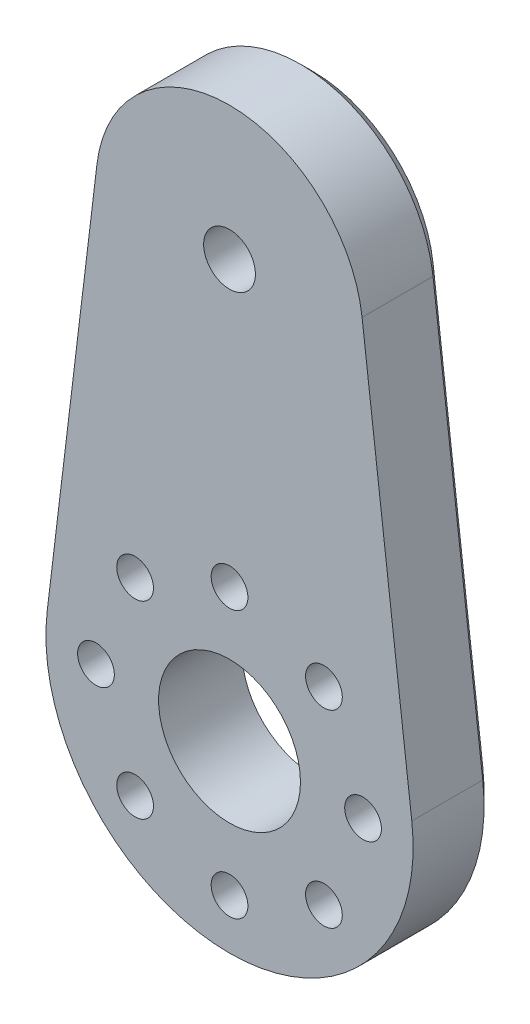
ISO-10303-21;
HEADER;
FILE_DESCRIPTION(('STEP AP214'),'2;1');
FILE_NAME('part.step','',(''),(''),'','','');
FILE_SCHEMA(('AUTOMOTIVE_DESIGN { 1 0 10303 214 1 1 1 1 }'));
ENDSEC;
DATA;
#1=APPLICATION_CONTEXT('core data for automotive mechanical design processes');
#2=APPLICATION_PROTOCOL_DEFINITION('international standard','automotive_design',2000,#1);
#3=PRODUCT_CONTEXT('',#1,'mechanical');
#4=PRODUCT('Part','Part','',(#3));
#5=PRODUCT_RELATED_PRODUCT_CATEGORY('part','',(#4));
#6=PRODUCT_DEFINITION_FORMATION('','',#4);
#7=PRODUCT_DEFINITION_CONTEXT('part definition',#1,'design');
#8=PRODUCT_DEFINITION('design','',#6,#7);
#9=PRODUCT_DEFINITION_SHAPE('','',#8);
#10=(LENGTH_UNIT() NAMED_UNIT(*) SI_UNIT(.MILLI.,.METRE.));
#11=(NAMED_UNIT(*) PLANE_ANGLE_UNIT() SI_UNIT($,.RADIAN.));
#12=(NAMED_UNIT(*) SI_UNIT($,.STERADIAN.) SOLID_ANGLE_UNIT());
#13=UNCERTAINTY_MEASURE_WITH_UNIT(LENGTH_MEASURE(1.E-05),#10,'distance_accuracy_value','');
#14=(GEOMETRIC_REPRESENTATION_CONTEXT(3) GLOBAL_UNCERTAINTY_ASSIGNED_CONTEXT((#13)) GLOBAL_UNIT_ASSIGNED_CONTEXT((#10,
#11,#12)) REPRESENTATION_CONTEXT('',''));
#15=CARTESIAN_POINT('',(0.,0.,0.));
#16=DIRECTION('',(0.,0.,1.));
#17=DIRECTION('',(1.,0.,0.));
#18=AXIS2_PLACEMENT_3D('',#15,#16,#17);
#19=CARTESIAN_POINT('',(-7.07862408504097,-19.7439036018759,5.));
#20=DIRECTION('',(0.,0.,-1.));
#21=DIRECTION('',(-1.,0.,0.));
#22=AXIS2_PLACEMENT_3D('',#19,#20,#21);
#23=CYLINDRICAL_SURFACE('',#22,1.1);
#24=CARTESIAN_POINT('',(-7.07862408504097,-19.7439036018759,5.));
#25=DIRECTION('',(0.,0.,1.));
#26=DIRECTION('',(1.,0.,0.));
#27=AXIS2_PLACEMENT_3D('',#24,#25,#26);
#28=CIRCLE('',#27,1.1);
#29=CARTESIAN_POINT('',(-5.97862408504097,-19.7439036018759,5.));
#30=VERTEX_POINT('',#29);
#31=EDGE_CURVE('E179',#30,#30,#28,.T.);
#32=ORIENTED_EDGE('',*,*,#31,.T.);
#33=EDGE_LOOP('',(#32));
#34=FACE_BOUND('',#33,.T.);
#35=CARTESIAN_POINT('',(-7.07862408504097,-19.7439036018759,2.25));
#36=DIRECTION('',(0.,0.,-1.));
#37=DIRECTION('',(-1.,0.,0.));
#38=AXIS2_PLACEMENT_3D('',#35,#36,#37);
#39=CIRCLE('',#38,1.1);
#40=CARTESIAN_POINT('',(-8.17862408504097,-19.7439036018759,2.25));
#41=VERTEX_POINT('',#40);
#42=EDGE_CURVE('E232',#41,#41,#39,.T.);
#43=ORIENTED_EDGE('',*,*,#42,.T.);
#44=EDGE_LOOP('',(#43));
#45=FACE_BOUND('',#44,.T.);
#46=ADVANCED_FACE('F33',(#34,#45),#23,.F.);
#47=CARTESIAN_POINT('',(-9.42176983554858,-25.4007578513683,5.));
#48=DIRECTION('',(0.,0.,-1.));
#49=DIRECTION('',(-1.,0.,0.));
#50=AXIS2_PLACEMENT_3D('',#47,#48,#49);
#51=CYLINDRICAL_SURFACE('',#50,1.1);
#52=CARTESIAN_POINT('',(-9.42176983554858,-25.4007578513683,5.));
#53=DIRECTION('',(0.,0.,1.));
#54=DIRECTION('',(1.,0.,0.));
#55=AXIS2_PLACEMENT_3D('',#52,#53,#54);
#56=CIRCLE('',#55,1.1);
#57=CARTESIAN_POINT('',(-8.32176983554858,-25.4007578513683,5.));
#58=VERTEX_POINT('',#57);
#59=EDGE_CURVE('E176',#58,#58,#56,.T.);
#60=ORIENTED_EDGE('',*,*,#59,.T.);
#61=EDGE_LOOP('',(#60));
#62=FACE_BOUND('',#61,.T.);
#63=CARTESIAN_POINT('',(-9.42176983554858,-25.4007578513683,2.25));
#64=DIRECTION('',(0.,0.,-1.));
#65=DIRECTION('',(-1.,0.,0.));
#66=AXIS2_PLACEMENT_3D('',#63,#64,#65);
#67=CIRCLE('',#66,1.1);
#68=CARTESIAN_POINT('',(-10.5217698355486,-25.4007578513683,2.25));
#69=VERTEX_POINT('',#68);
#70=EDGE_CURVE('E229',#69,#69,#67,.T.);
#71=ORIENTED_EDGE('',*,*,#70,.T.);
#72=EDGE_LOOP('',(#71));
#73=FACE_BOUND('',#72,.T.);
#74=ADVANCED_FACE('F330',(#62,#73),#51,.F.);
#75=CARTESIAN_POINT('',(-15.078624085041,-27.7439036018759,5.));
#76=DIRECTION('',(0.,0.,-1.));
#77=DIRECTION('',(-1.,0.,0.));
#78=AXIS2_PLACEMENT_3D('',#75,#76,#77);
#79=CYLINDRICAL_SURFACE('',#78,1.1);
#80=CARTESIAN_POINT('',(-15.078624085041,-27.7439036018759,5.));
#81=DIRECTION('',(0.,0.,1.));
#82=DIRECTION('',(1.,0.,0.));
#83=AXIS2_PLACEMENT_3D('',#80,#81,#82);
#84=CIRCLE('',#83,1.1);
#85=CARTESIAN_POINT('',(-13.978624085041,-27.7439036018759,5.));
#86=VERTEX_POINT('',#85);
#87=EDGE_CURVE('E173',#86,#86,#84,.T.);
#88=ORIENTED_EDGE('',*,*,#87,.T.);
#89=EDGE_LOOP('',(#88));
#90=FACE_BOUND('',#89,.T.);
#91=CARTESIAN_POINT('',(-15.078624085041,-27.7439036018759,2.25));
#92=DIRECTION('',(0.,0.,-1.));
#93=DIRECTION('',(-1.,0.,0.));
#94=AXIS2_PLACEMENT_3D('',#91,#92,#93);
#95=CIRCLE('',#94,1.1);
#96=CARTESIAN_POINT('',(-16.178624085041,-27.7439036018759,2.25));
#97=VERTEX_POINT('',#96);
#98=EDGE_CURVE('E226',#97,#97,#95,.T.);
#99=ORIENTED_EDGE('',*,*,#98,.T.);
#100=EDGE_LOOP('',(#99));
#101=FACE_BOUND('',#100,.T.);
#102=ADVANCED_FACE('F336',(#90,#101),#79,.F.);
#103=CARTESIAN_POINT('',(-20.7354783345333,-25.4007578513683,5.));
#104=DIRECTION('',(0.,0.,-1.));
#105=DIRECTION('',(-1.,0.,0.));
#106=AXIS2_PLACEMENT_3D('',#103,#104,#105);
#107=CYLINDRICAL_SURFACE('',#106,1.1);
#108=CARTESIAN_POINT('',(-20.7354783345333,-25.4007578513683,5.));
#109=DIRECTION('',(0.,0.,1.));
#110=DIRECTION('',(1.,0.,0.));
#111=AXIS2_PLACEMENT_3D('',#108,#109,#110);
#112=CIRCLE('',#111,1.1);
#113=CARTESIAN_POINT('',(-19.6354783345333,-25.4007578513683,5.));
#114=VERTEX_POINT('',#113);
#115=EDGE_CURVE('E170',#114,#114,#112,.T.);
#116=ORIENTED_EDGE('',*,*,#115,.T.);
#117=EDGE_LOOP('',(#116));
#118=FACE_BOUND('',#117,.T.);
#119=CARTESIAN_POINT('',(-20.7354783345333,-25.4007578513683,2.25));
#120=DIRECTION('',(0.,0.,-1.));
#121=DIRECTION('',(-1.,0.,0.));
#122=AXIS2_PLACEMENT_3D('',#119,#120,#121);
#123=CIRCLE('',#122,1.1);
#124=CARTESIAN_POINT('',(-21.8354783345333,-25.4007578513683,2.25));
#125=VERTEX_POINT('',#124);
#126=EDGE_CURVE('E223',#125,#125,#123,.T.);
#127=ORIENTED_EDGE('',*,*,#126,.T.);
#128=EDGE_LOOP('',(#127));
#129=FACE_BOUND('',#128,.T.);
#130=ADVANCED_FACE('F722',(#118,#129),#107,.F.);
#131=CARTESIAN_POINT('',(-23.078624085041,-19.7439036018759,5.));
#132=DIRECTION('',(0.,0.,-1.));
#133=DIRECTION('',(-1.,0.,0.));
#134=AXIS2_PLACEMENT_3D('',#131,#132,#133);
#135=CYLINDRICAL_SURFACE('',#134,1.1);
#136=CARTESIAN_POINT('',(-23.078624085041,-19.7439036018759,5.));
#137=DIRECTION('',(0.,0.,1.));
#138=DIRECTION('',(1.,0.,0.));
#139=AXIS2_PLACEMENT_3D('',#136,#137,#138);
#140=CIRCLE('',#139,1.1);
#141=CARTESIAN_POINT('',(-21.978624085041,-19.7439036018759,5.));
#142=VERTEX_POINT('',#141);
#143=EDGE_CURVE('E167',#142,#142,#140,.T.);
#144=ORIENTED_EDGE('',*,*,#143,.T.);
#145=EDGE_LOOP('',(#144));
#146=FACE_BOUND('',#145,.T.);
#147=CARTESIAN_POINT('',(-23.078624085041,-19.7439036018759,2.25));
#148=DIRECTION('',(0.,0.,-1.));
#149=DIRECTION('',(-1.,0.,0.));
#150=AXIS2_PLACEMENT_3D('',#147,#148,#149);
#151=CIRCLE('',#150,1.1);
#152=CARTESIAN_POINT('',(-24.178624085041,-19.7439036018759,2.25));
#153=VERTEX_POINT('',#152);
#154=EDGE_CURVE('E220',#153,#153,#151,.T.);
#155=ORIENTED_EDGE('',*,*,#154,.T.);
#156=EDGE_LOOP('',(#155));
#157=FACE_BOUND('',#156,.T.);
#158=ADVANCED_FACE('F731',(#146,#157),#135,.F.);
#159=CARTESIAN_POINT('',(-20.7354783345334,-14.0870493523836,5.));
#160=DIRECTION('',(0.,0.,-1.));
#161=DIRECTION('',(-1.,0.,0.));
#162=AXIS2_PLACEMENT_3D('',#159,#160,#161);
#163=CYLINDRICAL_SURFACE('',#162,1.1);
#164=CARTESIAN_POINT('',(-20.7354783345334,-14.0870493523836,5.));
#165=DIRECTION('',(0.,0.,1.));
#166=DIRECTION('',(1.,0.,0.));
#167=AXIS2_PLACEMENT_3D('',#164,#165,#166);
#168=CIRCLE('',#167,1.1);
#169=CARTESIAN_POINT('',(-19.6354783345334,-14.0870493523836,5.));
#170=VERTEX_POINT('',#169);
#171=EDGE_CURVE('E164',#170,#170,#168,.T.);
#172=ORIENTED_EDGE('',*,*,#171,.T.);
#173=EDGE_LOOP('',(#172));
#174=FACE_BOUND('',#173,.T.);
#175=CARTESIAN_POINT('',(-20.7354783345334,-14.0870493523836,2.25));
#176=DIRECTION('',(0.,0.,-1.));
#177=DIRECTION('',(-1.,0.,0.));
#178=AXIS2_PLACEMENT_3D('',#175,#176,#177);
#179=CIRCLE('',#178,1.1);
#180=CARTESIAN_POINT('',(-21.8354783345334,-14.0870493523836,2.25));
#181=VERTEX_POINT('',#180);
#182=EDGE_CURVE('E217',#181,#181,#179,.T.);
#183=ORIENTED_EDGE('',*,*,#182,.T.);
#184=EDGE_LOOP('',(#183));
#185=FACE_BOUND('',#184,.T.);
#186=ADVANCED_FACE('F741',(#174,#185),#163,.F.);
#187=CARTESIAN_POINT('',(-15.078624085041,-11.7439036018759,5.));
#188=DIRECTION('',(0.,0.,-1.));
#189=DIRECTION('',(-1.,0.,0.));
#190=AXIS2_PLACEMENT_3D('',#187,#188,#189);
#191=CYLINDRICAL_SURFACE('',#190,1.1);
#192=CARTESIAN_POINT('',(-15.078624085041,-11.7439036018759,5.));
#193=DIRECTION('',(0.,0.,1.));
#194=DIRECTION('',(1.,0.,0.));
#195=AXIS2_PLACEMENT_3D('',#192,#193,#194);
#196=CIRCLE('',#195,1.1);
#197=CARTESIAN_POINT('',(-13.978624085041,-11.7439036018759,5.));
#198=VERTEX_POINT('',#197);
#199=EDGE_CURVE('E161',#198,#198,#196,.T.);
#200=ORIENTED_EDGE('',*,*,#199,.T.);
#201=EDGE_LOOP('',(#200));
#202=FACE_BOUND('',#201,.T.);
#203=CARTESIAN_POINT('',(-15.078624085041,-11.7439036018759,2.25));
#204=DIRECTION('',(0.,0.,-1.));
#205=DIRECTION('',(-1.,0.,0.));
#206=AXIS2_PLACEMENT_3D('',#203,#204,#205);
#207=CIRCLE('',#206,1.1);
#208=CARTESIAN_POINT('',(-16.178624085041,-11.7439036018759,2.25));
#209=VERTEX_POINT('',#208);
#210=EDGE_CURVE('E213',#209,#209,#207,.T.);
#211=ORIENTED_EDGE('',*,*,#210,.T.);
#212=EDGE_LOOP('',(#211));
#213=FACE_BOUND('',#212,.T.);
#214=ADVANCED_FACE('F416',(#202,#213),#191,.F.);
#215=CARTESIAN_POINT('',(-9.42176983554858,-14.0870493523836,5.));
#216=DIRECTION('',(0.,0.,-1.));
#217=DIRECTION('',(-1.,0.,0.));
#218=AXIS2_PLACEMENT_3D('',#215,#216,#217);
#219=CYLINDRICAL_SURFACE('',#218,1.1);
#220=CARTESIAN_POINT('',(-9.42176983554858,-14.0870493523836,5.));
#221=DIRECTION('',(0.,0.,1.));
#222=DIRECTION('',(1.,0.,0.));
#223=AXIS2_PLACEMENT_3D('',#220,#221,#222);
#224=CIRCLE('',#223,1.1);
#225=CARTESIAN_POINT('',(-8.32176983554858,-14.0870493523836,5.));
#226=VERTEX_POINT('',#225);
#227=EDGE_CURVE('E153',#226,#226,#224,.T.);
#228=ORIENTED_EDGE('',*,*,#227,.T.);
#229=EDGE_LOOP('',(#228));
#230=FACE_BOUND('',#229,.T.);
#231=CARTESIAN_POINT('',(-9.42176983554858,-14.0870493523836,2.25));
#232=DIRECTION('',(0.,0.,-1.));
#233=DIRECTION('',(-1.,0.,0.));
#234=AXIS2_PLACEMENT_3D('',#231,#232,#233);
#235=CIRCLE('',#234,1.1);
#236=CARTESIAN_POINT('',(-10.5217698355486,-14.0870493523836,2.25));
#237=VERTEX_POINT('',#236);
#238=EDGE_CURVE('E210',#237,#237,#235,.T.);
#239=ORIENTED_EDGE('',*,*,#238,.T.);
#240=EDGE_LOOP('',(#239));
#241=FACE_BOUND('',#240,.T.);
#242=ADVANCED_FACE('F358',(#230,#241),#219,.F.);
#243=CARTESIAN_POINT('',(-15.078624085041,5.25609639812406,0.));
#244=DIRECTION('',(0.,0.,1.));
#245=DIRECTION('',(1.,0.,0.));
#246=AXIS2_PLACEMENT_3D('',#243,#244,#245);
#247=PLANE('',#246);
#248=CARTESIAN_POINT('',(-15.078624085041,-19.7439036018759,0.));
#249=DIRECTION('',(0.,0.,1.));
#250=DIRECTION('',(1.,0.,0.));
#251=AXIS2_PLACEMENT_3D('',#248,#249,#250);
#252=CIRCLE('',#251,10.25);
#253=CARTESIAN_POINT('',(-4.90269169532847,-18.5139036018759,0.));
#254=VERTEX_POINT('',#253);
#255=CARTESIAN_POINT('',(-25.2545564747535,-18.5139036018759,0.));
#256=VERTEX_POINT('',#255);
#257=EDGE_CURVE('E242',#254,#256,#252,.F.);
#258=ORIENTED_EDGE('',*,*,#257,.T.);
#259=DIRECTION('',(0.12,0.992773891679269,0.));
#260=VECTOR('',#259,1.);
#261=CARTESIAN_POINT('',(-22.2762347997157,6.12609639812406,0.));
#262=LINE('',#261,#260);
#263=CARTESIAN_POINT('',(-22.2762347997157,6.12609639812406,0.));
#264=VERTEX_POINT('',#263);
#265=EDGE_CURVE('E244',#256,#264,#262,.T.);
#266=ORIENTED_EDGE('',*,*,#265,.T.);
#267=CARTESIAN_POINT('',(-15.078624085041,5.25609639812406,0.));
#268=DIRECTION('',(0.,0.,1.));
#269=DIRECTION('',(1.,0.,0.));
#270=AXIS2_PLACEMENT_3D('',#267,#268,#269);
#271=CIRCLE('',#270,7.25);
#272=CARTESIAN_POINT('',(-7.88101337036627,6.12609639812406,0.));
#273=VERTEX_POINT('',#272);
#274=EDGE_CURVE('E240',#264,#273,#271,.F.);
#275=ORIENTED_EDGE('',*,*,#274,.T.);
#276=DIRECTION('',(0.12,-0.992773891679269,0.));
#277=VECTOR('',#276,1.);
#278=CARTESIAN_POINT('',(-7.88101337036627,6.12609639812406,0.));
#279=LINE('',#278,#277);
#280=EDGE_CURVE('E238',#273,#254,#279,.T.);
#281=ORIENTED_EDGE('',*,*,#280,.T.);
#282=EDGE_LOOP('',(#258,#266,#275,#281));
#283=FACE_BOUND('',#282,.T.);
#284=CARTESIAN_POINT('',(-20.7354783345333,-14.0870493523836,0.));
#285=DIRECTION('',(0.,0.,-1.));
#286=DIRECTION('',(-1.,0.,0.));
#287=AXIS2_PLACEMENT_3D('',#284,#285,#286);
#288=CIRCLE('',#287,1.75);
#289=CARTESIAN_POINT('',(-22.4854783345333,-14.0870493523836,0.));
#290=VERTEX_POINT('',#289);
#291=EDGE_CURVE('E258',#290,#290,#288,.T.);
#292=ORIENTED_EDGE('',*,*,#291,.F.);
#293=EDGE_LOOP('',(#292));
#294=FACE_BOUND('',#293,.T.);
#295=CARTESIAN_POINT('',(-15.078624085041,-11.7439036018759,0.));
#296=DIRECTION('',(0.,0.,-1.));
#297=DIRECTION('',(-1.,0.,0.));
#298=AXIS2_PLACEMENT_3D('',#295,#296,#297);
#299=CIRCLE('',#298,1.75);
#300=CARTESIAN_POINT('',(-16.828624085041,-11.7439036018759,0.));
#301=VERTEX_POINT('',#300);
#302=EDGE_CURVE('E269',#301,#301,#299,.T.);
#303=ORIENTED_EDGE('',*,*,#302,.F.);
#304=EDGE_LOOP('',(#303));
#305=FACE_BOUND('',#304,.T.);
#306=CARTESIAN_POINT('',(-9.42176983554858,-14.0870493523836,0.));
#307=DIRECTION('',(0.,0.,-1.));
#308=DIRECTION('',(-1.,0.,0.));
#309=AXIS2_PLACEMENT_3D('',#306,#307,#308);
#310=CIRCLE('',#309,1.75);
#311=CARTESIAN_POINT('',(-11.1717698355486,-14.0870493523836,0.));
#312=VERTEX_POINT('',#311);
#313=EDGE_CURVE('E431',#312,#312,#310,.T.);
#314=ORIENTED_EDGE('',*,*,#313,.F.);
#315=EDGE_LOOP('',(#314));
#316=FACE_BOUND('',#315,.T.);
#317=CARTESIAN_POINT('',(-7.07862408504097,-19.7439036018759,0.));
#318=DIRECTION('',(0.,0.,-1.));
#319=DIRECTION('',(-1.,0.,0.));
#320=AXIS2_PLACEMENT_3D('',#317,#318,#319);
#321=CIRCLE('',#320,1.75);
#322=CARTESIAN_POINT('',(-8.82862408504097,-19.7439036018759,0.));
#323=VERTEX_POINT('',#322);
#324=EDGE_CURVE('E430',#323,#323,#321,.T.);
#325=ORIENTED_EDGE('',*,*,#324,.F.);
#326=EDGE_LOOP('',(#325));
#327=FACE_BOUND('',#326,.T.);
#328=CARTESIAN_POINT('',(-9.42176983554858,-25.4007578513683,0.));
#329=DIRECTION('',(0.,0.,-1.));
#330=DIRECTION('',(-1.,0.,0.));
#331=AXIS2_PLACEMENT_3D('',#328,#329,#330);
#332=CIRCLE('',#331,1.75);
#333=CARTESIAN_POINT('',(-11.1717698355486,-25.4007578513683,0.));
#334=VERTEX_POINT('',#333);
#335=EDGE_CURVE('E454',#334,#334,#332,.T.);
#336=ORIENTED_EDGE('',*,*,#335,.F.);
#337=EDGE_LOOP('',(#336));
#338=FACE_BOUND('',#337,.T.);
#339=CARTESIAN_POINT('',(-15.078624085041,-27.7439036018759,0.));
#340=DIRECTION('',(0.,0.,-1.));
#341=DIRECTION('',(-1.,0.,0.));
#342=AXIS2_PLACEMENT_3D('',#339,#340,#341);
#343=CIRCLE('',#342,1.75);
#344=CARTESIAN_POINT('',(-16.828624085041,-27.7439036018759,0.));
#345=VERTEX_POINT('',#344);
#346=EDGE_CURVE('E458',#345,#345,#343,.T.);
#347=ORIENTED_EDGE('',*,*,#346,.F.);
#348=EDGE_LOOP('',(#347));
#349=FACE_BOUND('',#348,.T.);
#350=CARTESIAN_POINT('',(-20.7354783345333,-25.4007578513683,0.));
#351=DIRECTION('',(0.,0.,-1.));
#352=DIRECTION('',(-1.,0.,0.));
#353=AXIS2_PLACEMENT_3D('',#350,#351,#352);
#354=CIRCLE('',#353,1.74999999999999);
#355=CARTESIAN_POINT('',(-22.4854783345333,-25.4007578513683,0.));
#356=VERTEX_POINT('',#355);
#357=EDGE_CURVE('E462',#356,#356,#354,.T.);
#358=ORIENTED_EDGE('',*,*,#357,.F.);
#359=EDGE_LOOP('',(#358));
#360=FACE_BOUND('',#359,.T.);
#361=CARTESIAN_POINT('',(-23.078624085041,-19.7439036018759,0.));
#362=DIRECTION('',(0.,0.,-1.));
#363=DIRECTION('',(-1.,0.,0.));
#364=AXIS2_PLACEMENT_3D('',#361,#362,#363);
#365=CIRCLE('',#364,1.75);
#366=CARTESIAN_POINT('',(-24.828624085041,-19.7439036018759,0.));
#367=VERTEX_POINT('',#366);
#368=EDGE_CURVE('E275',#367,#367,#365,.T.);
#369=ORIENTED_EDGE('',*,*,#368,.F.);
#370=EDGE_LOOP('',(#369));
#371=FACE_BOUND('',#370,.T.);
#372=CARTESIAN_POINT('',(-15.078624085041,-19.7439036018759,0.));
#373=DIRECTION('',(0.,0.,1.));
#374=DIRECTION('',(1.,0.,0.));
#375=AXIS2_PLACEMENT_3D('',#372,#373,#374);
#376=CIRCLE('',#375,4.25);
#377=CARTESIAN_POINT('',(-10.828624085041,-19.7439036018759,0.));
#378=VERTEX_POINT('',#377);
#379=EDGE_CURVE('E182',#378,#378,#376,.T.);
#380=ORIENTED_EDGE('',*,*,#379,.T.);
#381=EDGE_LOOP('',(#380));
#382=FACE_BOUND('',#381,.T.);
#383=DIRECTION('',(1.,0.,0.));
#384=VECTOR('',#383,1.);
#385=CARTESIAN_POINT('',(-16.6663373253124,2.50609639812406,0.));
#386=LINE('',#385,#384);
#387=CARTESIAN_POINT('',(-16.6663373253124,2.50609639812406,0.));
#388=VERTEX_POINT('',#387);
#389=CARTESIAN_POINT('',(-13.4909108447695,2.50609639812407,0.));
#390=VERTEX_POINT('',#389);
#391=EDGE_CURVE('E235',#388,#390,#386,.T.);
#392=ORIENTED_EDGE('',*,*,#391,.T.);
#393=DIRECTION('',(0.5,0.866025403784439,0.));
#394=VECTOR('',#393,1.);
#395=CARTESIAN_POINT('',(-13.4909108447695,2.50609639812407,0.));
#396=LINE('',#395,#394);
#397=CARTESIAN_POINT('',(-11.903197604498,5.25609639812406,0.));
#398=VERTEX_POINT('',#397);
#399=EDGE_CURVE('E148',#390,#398,#396,.T.);
#400=ORIENTED_EDGE('',*,*,#399,.T.);
#401=DIRECTION('',(-0.5,0.866025403784439,0.));
#402=VECTOR('',#401,1.);
#403=CARTESIAN_POINT('',(-11.903197604498,5.25609639812406,0.));
#404=LINE('',#403,#402);
#405=CARTESIAN_POINT('',(-13.4909108447695,8.00609639812406,0.));
#406=VERTEX_POINT('',#405);
#407=EDGE_CURVE('E288',#398,#406,#404,.T.);
#408=ORIENTED_EDGE('',*,*,#407,.T.);
#409=DIRECTION('',(-1.,0.,0.));
#410=VECTOR('',#409,1.);
#411=CARTESIAN_POINT('',(-13.4909108447695,8.00609639812406,0.));
#412=LINE('',#411,#410);
#413=CARTESIAN_POINT('',(-16.6663373253124,8.00609639812406,0.));
#414=VERTEX_POINT('',#413);
#415=EDGE_CURVE('E291',#406,#414,#412,.T.);
#416=ORIENTED_EDGE('',*,*,#415,.T.);
#417=DIRECTION('',(-0.499999999999999,-0.866025403784439,0.));
#418=VECTOR('',#417,1.);
#419=CARTESIAN_POINT('',(-16.6663373253124,8.00609639812406,0.));
#420=LINE('',#419,#418);
#421=CARTESIAN_POINT('',(-18.2540505655839,5.25609639812407,0.));
#422=VERTEX_POINT('',#421);
#423=EDGE_CURVE('E294',#414,#422,#420,.T.);
#424=ORIENTED_EDGE('',*,*,#423,.T.);
#425=DIRECTION('',(0.5,-0.866025403784438,0.));
#426=VECTOR('',#425,1.);
#427=CARTESIAN_POINT('',(-18.2540505655839,5.25609639812407,0.));
#428=LINE('',#427,#426);
#429=EDGE_CURVE('E144',#422,#388,#428,.T.);
#430=ORIENTED_EDGE('',*,*,#429,.T.);
#431=EDGE_LOOP('',(#392,#400,#408,#416,#424,#430));
#432=FACE_BOUND('',#431,.T.);
#433=ADVANCED_FACE('F313',(#283,#294,#305,#316,#327,#338,#349,#360,#371,#382,#432),#247,.F.);
#434=CARTESIAN_POINT('',(-15.078624085041,5.25609639812406,5.));
#435=DIRECTION('',(0.,0.,1.));
#436=DIRECTION('',(1.,0.,0.));
#437=AXIS2_PLACEMENT_3D('',#434,#435,#436);
#438=PLANE('',#437);
#439=ORIENTED_EDGE('',*,*,#199,.F.);
#440=EDGE_LOOP('',(#439));
#441=FACE_BOUND('',#440,.T.);
#442=ORIENTED_EDGE('',*,*,#143,.F.);
#443=EDGE_LOOP('',(#442));
#444=FACE_BOUND('',#443,.T.);
#445=ORIENTED_EDGE('',*,*,#87,.F.);
#446=EDGE_LOOP('',(#445));
#447=FACE_BOUND('',#446,.T.);
#448=ORIENTED_EDGE('',*,*,#31,.F.);
#449=EDGE_LOOP('',(#448));
#450=FACE_BOUND('',#449,.T.);
#451=CARTESIAN_POINT('',(-15.078624085041,5.25609639812406,5.));
#452=DIRECTION('',(0.,0.,1.));
#453=DIRECTION('',(1.,0.,0.));
#454=AXIS2_PLACEMENT_3D('',#451,#452,#453);
#455=CIRCLE('',#454,1.55);
#456=CARTESIAN_POINT('',(-13.528624085041,5.25609639812406,5.));
#457=VERTEX_POINT('',#456);
#458=EDGE_CURVE('E186',#457,#457,#455,.T.);
#459=ORIENTED_EDGE('',*,*,#458,.F.);
#460=EDGE_LOOP('',(#459));
#461=FACE_BOUND('',#460,.T.);
#462=CARTESIAN_POINT('',(-15.078624085041,5.25609639812406,5.));
#463=DIRECTION('',(0.,0.,1.));
#464=DIRECTION('',(1.,0.,0.));
#465=AXIS2_PLACEMENT_3D('',#462,#463,#464);
#466=CIRCLE('',#465,8.);
#467=CARTESIAN_POINT('',(-7.13643295160682,6.21609639812406,5.));
#468=VERTEX_POINT('',#467);
#469=CARTESIAN_POINT('',(-23.0208152184751,6.21609639812406,5.));
#470=VERTEX_POINT('',#469);
#471=EDGE_CURVE('E191',#468,#470,#466,.T.);
#472=ORIENTED_EDGE('',*,*,#471,.T.);
#473=DIRECTION('',(-0.12,-0.992773891679269,0.));
#474=VECTOR('',#473,1.);
#475=CARTESIAN_POINT('',(-23.0208152184751,6.21609639812406,5.));
#476=LINE('',#475,#474);
#477=CARTESIAN_POINT('',(-25.9991368935129,-18.4239036018759,5.));
#478=VERTEX_POINT('',#477);
#479=EDGE_CURVE('E194',#470,#478,#476,.T.);
#480=ORIENTED_EDGE('',*,*,#479,.T.);
#481=CARTESIAN_POINT('',(-15.078624085041,-19.7439036018759,5.));
#482=DIRECTION('',(0.,0.,1.));
#483=DIRECTION('',(1.,0.,0.));
#484=AXIS2_PLACEMENT_3D('',#481,#482,#483);
#485=CIRCLE('',#484,11.);
#486=CARTESIAN_POINT('',(-4.15811127656901,-18.4239036018759,5.));
#487=VERTEX_POINT('',#486);
#488=EDGE_CURVE('E196',#478,#487,#485,.T.);
#489=ORIENTED_EDGE('',*,*,#488,.T.);
#490=DIRECTION('',(-0.12,0.992773891679269,0.));
#491=VECTOR('',#490,1.);
#492=CARTESIAN_POINT('',(-7.13643295160682,6.21609639812406,5.));
#493=LINE('',#492,#491);
#494=EDGE_CURVE('E198',#487,#468,#493,.T.);
#495=ORIENTED_EDGE('',*,*,#494,.T.);
#496=EDGE_LOOP('',(#472,#480,#489,#495));
#497=FACE_BOUND('',#496,.T.);
#498=CARTESIAN_POINT('',(-15.078624085041,-19.7439036018759,5.));
#499=DIRECTION('',(0.,0.,1.));
#500=DIRECTION('',(1.,0.,0.));
#501=AXIS2_PLACEMENT_3D('',#498,#499,#500);
#502=CIRCLE('',#501,4.25);
#503=CARTESIAN_POINT('',(-10.828624085041,-19.7439036018759,5.));
#504=VERTEX_POINT('',#503);
#505=EDGE_CURVE('E183',#504,#504,#502,.T.);
#506=ORIENTED_EDGE('',*,*,#505,.F.);
#507=EDGE_LOOP('',(#506));
#508=FACE_BOUND('',#507,.T.);
#509=ORIENTED_EDGE('',*,*,#59,.F.);
#510=EDGE_LOOP('',(#509));
#511=FACE_BOUND('',#510,.T.);
#512=ORIENTED_EDGE('',*,*,#115,.F.);
#513=EDGE_LOOP('',(#512));
#514=FACE_BOUND('',#513,.T.);
#515=ORIENTED_EDGE('',*,*,#171,.F.);
#516=EDGE_LOOP('',(#515));
#517=FACE_BOUND('',#516,.T.);
#518=ORIENTED_EDGE('',*,*,#227,.F.);
#519=EDGE_LOOP('',(#518));
#520=FACE_BOUND('',#519,.T.);
#521=ADVANCED_FACE('F351',(#441,#444,#447,#450,#461,#497,#508,#511,#514,#517,#520),#438,.T.);
#522=CARTESIAN_POINT('',(-15.078624085041,5.25609639812406,5.));
#523=DIRECTION('',(0.,0.,-1.));
#524=DIRECTION('',(-1.,0.,0.));
#525=AXIS2_PLACEMENT_3D('',#522,#523,#524);
#526=CYLINDRICAL_SURFACE('',#525,8.);
#527=DIRECTION('',(0.,0.,-1.));
#528=VECTOR('',#527,1.);
#529=CARTESIAN_POINT('',(-7.13643295160682,6.21609639812406,5.));
#530=LINE('',#529,#528);
#531=CARTESIAN_POINT('',(-7.13643295160682,6.21609639812406,0.749999999999994));
#532=VERTEX_POINT('',#531);
#533=EDGE_CURVE('E200',#468,#532,#530,.T.);
#534=ORIENTED_EDGE('',*,*,#533,.T.);
#535=CARTESIAN_POINT('',(-15.078624085041,5.25609639812406,0.749999999999994));
#536=DIRECTION('',(0.,0.,1.));
#537=DIRECTION('',(1.,0.,0.));
#538=AXIS2_PLACEMENT_3D('',#535,#536,#537);
#539=CIRCLE('',#538,8.);
#540=CARTESIAN_POINT('',(-23.0208152184751,6.21609639812406,0.749999999999994));
#541=VERTEX_POINT('',#540);
#542=EDGE_CURVE('E42',#532,#541,#539,.T.);
#543=ORIENTED_EDGE('',*,*,#542,.T.);
#544=DIRECTION('',(0.,0.,-1.));
#545=VECTOR('',#544,1.);
#546=CARTESIAN_POINT('',(-23.0208152184751,6.21609639812406,5.));
#547=LINE('',#546,#545);
#548=EDGE_CURVE('E206',#470,#541,#547,.T.);
#549=ORIENTED_EDGE('',*,*,#548,.F.);
#550=ORIENTED_EDGE('',*,*,#471,.F.);
#551=EDGE_LOOP('',(#534,#543,#549,#550));
#552=FACE_BOUND('',#551,.T.);
#553=ADVANCED_FACE('F354',(#552),#526,.T.);
#554=CARTESIAN_POINT('',(-23.0208152184751,6.21609639812406,5.));
#555=DIRECTION('',(0.992773891679269,-0.12,0.));
#556=DIRECTION('',(0.12,0.992773891679269,0.));
#557=AXIS2_PLACEMENT_3D('',#554,#555,#556);
#558=PLANE('',#557);
#559=ORIENTED_EDGE('',*,*,#548,.T.);
#560=DIRECTION('',(-0.12,-0.992773891679269,0.));
#561=VECTOR('',#560,1.);
#562=CARTESIAN_POINT('',(-23.0208152184751,6.21609639812406,0.749999999999994));
#563=LINE('',#562,#561);
#564=CARTESIAN_POINT('',(-25.9991368935129,-18.4239036018759,0.749999999999994));
#565=VERTEX_POINT('',#564);
#566=EDGE_CURVE('E208',#541,#565,#563,.T.);
#567=ORIENTED_EDGE('',*,*,#566,.T.);
#568=DIRECTION('',(0.,0.,-1.));
#569=VECTOR('',#568,1.);
#570=CARTESIAN_POINT('',(-25.9991368935129,-18.4239036018759,5.));
#571=LINE('',#570,#569);
#572=EDGE_CURVE('E204',#478,#565,#571,.T.);
#573=ORIENTED_EDGE('',*,*,#572,.F.);
#574=ORIENTED_EDGE('',*,*,#479,.F.);
#575=EDGE_LOOP('',(#559,#567,#573,#574));
#576=FACE_BOUND('',#575,.T.);
#577=ADVANCED_FACE('F365',(#576),#558,.F.);
#578=CARTESIAN_POINT('',(-15.078624085041,-19.7439036018759,5.));
#579=DIRECTION('',(0.,0.,-1.));
#580=DIRECTION('',(-1.,0.,0.));
#581=AXIS2_PLACEMENT_3D('',#578,#579,#580);
#582=CYLINDRICAL_SURFACE('',#581,11.);
#583=ORIENTED_EDGE('',*,*,#572,.T.);
#584=CARTESIAN_POINT('',(-15.078624085041,-19.7439036018759,0.749999999999994));
#585=DIRECTION('',(0.,0.,1.));
#586=DIRECTION('',(1.,0.,0.));
#587=AXIS2_PLACEMENT_3D('',#584,#585,#586);
#588=CIRCLE('',#587,11.);
#589=CARTESIAN_POINT('',(-4.15811127656901,-18.4239036018759,0.749999999999994));
#590=VERTEX_POINT('',#589);
#591=EDGE_CURVE('E56',#565,#590,#588,.T.);
#592=ORIENTED_EDGE('',*,*,#591,.T.);
#593=DIRECTION('',(0.,0.,-1.));
#594=VECTOR('',#593,1.);
#595=CARTESIAN_POINT('',(-4.15811127656901,-18.4239036018759,5.));
#596=LINE('',#595,#594);
#597=EDGE_CURVE('E202',#487,#590,#596,.T.);
#598=ORIENTED_EDGE('',*,*,#597,.F.);
#599=ORIENTED_EDGE('',*,*,#488,.F.);
#600=EDGE_LOOP('',(#583,#592,#598,#599));
#601=FACE_BOUND('',#600,.T.);
#602=ADVANCED_FACE('F362',(#601),#582,.T.);
#603=CARTESIAN_POINT('',(-7.13643295160682,6.21609639812406,5.));
#604=DIRECTION('',(-0.992773891679269,-0.12,0.));
#605=DIRECTION('',(0.12,-0.992773891679269,0.));
#606=AXIS2_PLACEMENT_3D('',#603,#604,#605);
#607=PLANE('',#606);
#608=ORIENTED_EDGE('',*,*,#597,.T.);
#609=DIRECTION('',(-0.12,0.992773891679269,0.));
#610=VECTOR('',#609,1.);
#611=CARTESIAN_POINT('',(-7.13643295160682,6.21609639812406,0.749999999999994));
#612=LINE('',#611,#610);
#613=EDGE_CURVE('E11',#590,#532,#612,.T.);
#614=ORIENTED_EDGE('',*,*,#613,.T.);
#615=ORIENTED_EDGE('',*,*,#533,.F.);
#616=ORIENTED_EDGE('',*,*,#494,.F.);
#617=EDGE_LOOP('',(#608,#614,#615,#616));
#618=FACE_BOUND('',#617,.T.);
#619=ADVANCED_FACE('F349',(#618),#607,.F.);
#620=CARTESIAN_POINT('',(-15.078624085041,5.25609639812406,5.));
#621=DIRECTION('',(0.,0.,-1.));
#622=DIRECTION('',(-1.,0.,0.));
#623=AXIS2_PLACEMENT_3D('',#620,#621,#622);
#624=CYLINDRICAL_SURFACE('',#623,1.55);
#625=CARTESIAN_POINT('',(-15.078624085041,5.25609639812406,2.));
#626=DIRECTION('',(0.,0.,1.));
#627=DIRECTION('',(1.,0.,0.));
#628=AXIS2_PLACEMENT_3D('',#625,#626,#627);
#629=CIRCLE('',#628,1.55);
#630=CARTESIAN_POINT('',(-13.528624085041,5.25609639812406,2.));
#631=VERTEX_POINT('',#630);
#632=EDGE_CURVE('E149',#631,#631,#629,.T.);
#633=ORIENTED_EDGE('',*,*,#632,.F.);
#634=EDGE_LOOP('',(#633));
#635=FACE_BOUND('',#634,.T.);
#636=ORIENTED_EDGE('',*,*,#458,.T.);
#637=EDGE_LOOP('',(#636));
#638=FACE_BOUND('',#637,.T.);
#639=ADVANCED_FACE('F345',(#635,#638),#624,.F.);
#640=CARTESIAN_POINT('',(-15.078624085041,-19.7439036018759,5.));
#641=DIRECTION('',(0.,0.,-1.));
#642=DIRECTION('',(-1.,0.,0.));
#643=AXIS2_PLACEMENT_3D('',#640,#641,#642);
#644=CYLINDRICAL_SURFACE('',#643,4.25);
#645=ORIENTED_EDGE('',*,*,#505,.T.);
#646=EDGE_LOOP('',(#645));
#647=FACE_BOUND('',#646,.T.);
#648=ORIENTED_EDGE('',*,*,#379,.F.);
#649=EDGE_LOOP('',(#648));
#650=FACE_BOUND('',#649,.T.);
#651=ADVANCED_FACE('F342',(#647,#650),#644,.F.);
#652=CARTESIAN_POINT('',(-16.6663373253124,2.50609639812406,2.));
#653=DIRECTION('',(0.,1.,0.));
#654=DIRECTION('',(-1.,0.,0.));
#655=AXIS2_PLACEMENT_3D('',#652,#653,#654);
#656=PLANE('',#655);
#657=ORIENTED_EDGE('',*,*,#391,.F.);
#658=DIRECTION('',(0.,0.,-1.));
#659=VECTOR('',#658,1.);
#660=CARTESIAN_POINT('',(-16.6663373253124,2.50609639812406,2.));
#661=LINE('',#660,#659);
#662=CARTESIAN_POINT('',(-16.6663373253124,2.50609639812406,2.));
#663=VERTEX_POINT('',#662);
#664=EDGE_CURVE('E143',#663,#388,#661,.T.);
#665=ORIENTED_EDGE('',*,*,#664,.F.);
#666=DIRECTION('',(1.,0.,0.));
#667=VECTOR('',#666,1.);
#668=CARTESIAN_POINT('',(-16.6663373253124,2.50609639812406,2.));
#669=LINE('',#668,#667);
#670=CARTESIAN_POINT('',(-13.4909108447695,2.50609639812407,2.));
#671=VERTEX_POINT('',#670);
#672=EDGE_CURVE('E129',#663,#671,#669,.T.);
#673=ORIENTED_EDGE('',*,*,#672,.T.);
#674=DIRECTION('',(0.,0.,-1.));
#675=VECTOR('',#674,1.);
#676=CARTESIAN_POINT('',(-13.4909108447695,2.50609639812407,2.));
#677=LINE('',#676,#675);
#678=EDGE_CURVE('E140',#671,#390,#677,.T.);
#679=ORIENTED_EDGE('',*,*,#678,.T.);
#680=EDGE_LOOP('',(#657,#665,#673,#679));
#681=FACE_BOUND('',#680,.T.);
#682=ADVANCED_FACE('F139',(#681),#656,.T.);
#683=CARTESIAN_POINT('',(-13.4909108447695,2.50609639812407,2.));
#684=DIRECTION('',(-0.866025403784439,0.5,0.));
#685=DIRECTION('',(-0.5,-0.866025403784439,0.));
#686=AXIS2_PLACEMENT_3D('',#683,#684,#685);
#687=PLANE('',#686);
#688=ORIENTED_EDGE('',*,*,#399,.F.);
#689=ORIENTED_EDGE('',*,*,#678,.F.);
#690=DIRECTION('',(0.5,0.866025403784439,0.));
#691=VECTOR('',#690,1.);
#692=CARTESIAN_POINT('',(-13.4909108447695,2.50609639812407,2.));
#693=LINE('',#692,#691);
#694=CARTESIAN_POINT('',(-11.903197604498,5.25609639812406,2.));
#695=VERTEX_POINT('',#694);
#696=EDGE_CURVE('E125',#671,#695,#693,.T.);
#697=ORIENTED_EDGE('',*,*,#696,.T.);
#698=DIRECTION('',(0.,0.,-1.));
#699=VECTOR('',#698,1.);
#700=CARTESIAN_POINT('',(-11.903197604498,5.25609639812406,2.));
#701=LINE('',#700,#699);
#702=EDGE_CURVE('E150',#695,#398,#701,.T.);
#703=ORIENTED_EDGE('',*,*,#702,.T.);
#704=EDGE_LOOP('',(#688,#689,#697,#703));
#705=FACE_BOUND('',#704,.T.);
#706=ADVANCED_FACE('F146',(#705),#687,.T.);
#707=CARTESIAN_POINT('',(-11.903197604498,5.25609639812406,2.));
#708=DIRECTION('',(-0.866025403784439,-0.5,0.));
#709=DIRECTION('',(0.5,-0.866025403784439,0.));
#710=AXIS2_PLACEMENT_3D('',#707,#708,#709);
#711=PLANE('',#710);
#712=ORIENTED_EDGE('',*,*,#407,.F.);
#713=ORIENTED_EDGE('',*,*,#702,.F.);
#714=DIRECTION('',(-0.5,0.866025403784439,0.));
#715=VECTOR('',#714,1.);
#716=CARTESIAN_POINT('',(-11.903197604498,5.25609639812406,2.));
#717=LINE('',#716,#715);
#718=CARTESIAN_POINT('',(-13.4909108447695,8.00609639812406,2.));
#719=VERTEX_POINT('',#718);
#720=EDGE_CURVE('E131',#695,#719,#717,.T.);
#721=ORIENTED_EDGE('',*,*,#720,.T.);
#722=DIRECTION('',(0.,0.,-1.));
#723=VECTOR('',#722,1.);
#724=CARTESIAN_POINT('',(-13.4909108447695,8.00609639812406,2.));
#725=LINE('',#724,#723);
#726=EDGE_CURVE('E155',#719,#406,#725,.T.);
#727=ORIENTED_EDGE('',*,*,#726,.T.);
#728=EDGE_LOOP('',(#712,#713,#721,#727));
#729=FACE_BOUND('',#728,.T.);
#730=ADVANCED_FACE('F307',(#729),#711,.T.);
#731=CARTESIAN_POINT('',(-13.4909108447695,8.00609639812406,2.));
#732=DIRECTION('',(0.,-1.,0.));
#733=DIRECTION('',(0.,0.,-1.));
#734=AXIS2_PLACEMENT_3D('',#731,#732,#733);
#735=PLANE('',#734);
#736=ORIENTED_EDGE('',*,*,#415,.F.);
#737=ORIENTED_EDGE('',*,*,#726,.F.);
#738=DIRECTION('',(-1.,0.,0.));
#739=VECTOR('',#738,1.);
#740=CARTESIAN_POINT('',(-13.4909108447695,8.00609639812406,2.));
#741=LINE('',#740,#739);
#742=CARTESIAN_POINT('',(-16.6663373253124,8.00609639812406,2.));
#743=VERTEX_POINT('',#742);
#744=EDGE_CURVE('E280',#719,#743,#741,.T.);
#745=ORIENTED_EDGE('',*,*,#744,.T.);
#746=DIRECTION('',(0.,0.,-1.));
#747=VECTOR('',#746,1.);
#748=CARTESIAN_POINT('',(-16.6663373253124,8.00609639812406,2.));
#749=LINE('',#748,#747);
#750=EDGE_CURVE('E302',#743,#414,#749,.T.);
#751=ORIENTED_EDGE('',*,*,#750,.T.);
#752=EDGE_LOOP('',(#736,#737,#745,#751));
#753=FACE_BOUND('',#752,.T.);
#754=ADVANCED_FACE('F309',(#753),#735,.T.);
#755=CARTESIAN_POINT('',(-16.6663373253124,8.00609639812406,2.));
#756=DIRECTION('',(0.866025403784439,-0.499999999999999,0.));
#757=DIRECTION('',(0.5,0.866025403784439,0.));
#758=AXIS2_PLACEMENT_3D('',#755,#756,#757);
#759=PLANE('',#758);
#760=ORIENTED_EDGE('',*,*,#423,.F.);
#761=ORIENTED_EDGE('',*,*,#750,.F.);
#762=DIRECTION('',(-0.499999999999999,-0.866025403784439,0.));
#763=VECTOR('',#762,1.);
#764=CARTESIAN_POINT('',(-16.6663373253124,8.00609639812406,2.));
#765=LINE('',#764,#763);
#766=CARTESIAN_POINT('',(-18.2540505655839,5.25609639812407,2.));
#767=VERTEX_POINT('',#766);
#768=EDGE_CURVE('E282',#743,#767,#765,.T.);
#769=ORIENTED_EDGE('',*,*,#768,.T.);
#770=DIRECTION('',(0.,0.,-1.));
#771=VECTOR('',#770,1.);
#772=CARTESIAN_POINT('',(-18.2540505655839,5.25609639812407,2.));
#773=LINE('',#772,#771);
#774=EDGE_CURVE('E300',#767,#422,#773,.T.);
#775=ORIENTED_EDGE('',*,*,#774,.T.);
#776=EDGE_LOOP('',(#760,#761,#769,#775));
#777=FACE_BOUND('',#776,.T.);
#778=ADVANCED_FACE('F320',(#777),#759,.T.);
#779=CARTESIAN_POINT('',(-18.2540505655839,5.25609639812407,2.));
#780=DIRECTION('',(0.866025403784439,0.5,0.));
#781=DIRECTION('',(-0.5,0.866025403784438,0.));
#782=AXIS2_PLACEMENT_3D('',#779,#780,#781);
#783=PLANE('',#782);
#784=ORIENTED_EDGE('',*,*,#429,.F.);
#785=ORIENTED_EDGE('',*,*,#774,.F.);
#786=DIRECTION('',(0.5,-0.866025403784438,0.));
#787=VECTOR('',#786,1.);
#788=CARTESIAN_POINT('',(-18.2540505655839,5.25609639812407,2.));
#789=LINE('',#788,#787);
#790=EDGE_CURVE('E284',#767,#663,#789,.T.);
#791=ORIENTED_EDGE('',*,*,#790,.T.);
#792=ORIENTED_EDGE('',*,*,#664,.T.);
#793=EDGE_LOOP('',(#784,#785,#791,#792));
#794=FACE_BOUND('',#793,.T.);
#795=ADVANCED_FACE('F316',(#794),#783,.T.);
#796=CARTESIAN_POINT('',(0.,0.,2.));
#797=DIRECTION('',(0.,0.,1.));
#798=DIRECTION('',(1.,0.,0.));
#799=AXIS2_PLACEMENT_3D('',#796,#797,#798);
#800=PLANE('',#799);
#801=ORIENTED_EDGE('',*,*,#632,.T.);
#802=EDGE_LOOP('',(#801));
#803=FACE_BOUND('',#802,.T.);
#804=ORIENTED_EDGE('',*,*,#672,.F.);
#805=ORIENTED_EDGE('',*,*,#790,.F.);
#806=ORIENTED_EDGE('',*,*,#768,.F.);
#807=ORIENTED_EDGE('',*,*,#744,.F.);
#808=ORIENTED_EDGE('',*,*,#720,.F.);
#809=ORIENTED_EDGE('',*,*,#696,.F.);
#810=EDGE_LOOP('',(#804,#805,#806,#807,#808,#809));
#811=FACE_BOUND('',#810,.T.);
#812=ADVANCED_FACE('F127',(#803,#811),#800,.F.);
#813=CARTESIAN_POINT('',(-9.42176983554858,-14.0870493523836,2.25));
#814=DIRECTION('',(0.,0.,-1.));
#815=DIRECTION('',(-1.,0.,0.));
#816=AXIS2_PLACEMENT_3D('',#813,#814,#815);
#817=CYLINDRICAL_SURFACE('',#816,1.75);
#818=CARTESIAN_POINT('',(-9.42176983554858,-14.0870493523836,2.25));
#819=DIRECTION('',(0.,0.,-1.));
#820=DIRECTION('',(-1.,0.,0.));
#821=AXIS2_PLACEMENT_3D('',#818,#819,#820);
#822=CIRCLE('',#821,1.75);
#823=CARTESIAN_POINT('',(-11.1717698355486,-14.0870493523836,2.25));
#824=VERTEX_POINT('',#823);
#825=EDGE_CURVE('E428',#824,#824,#822,.T.);
#826=ORIENTED_EDGE('',*,*,#825,.F.);
#827=EDGE_LOOP('',(#826));
#828=FACE_BOUND('',#827,.T.);
#829=ORIENTED_EDGE('',*,*,#313,.T.);
#830=EDGE_LOOP('',(#829));
#831=FACE_BOUND('',#830,.T.);
#832=ADVANCED_FACE('F424',(#828,#831),#817,.F.);
#833=CARTESIAN_POINT('',(-9.42176983554858,-14.0870493523836,2.25));
#834=DIRECTION('',(0.,0.,-1.));
#835=DIRECTION('',(-1.,0.,0.));
#836=AXIS2_PLACEMENT_3D('',#833,#834,#835);
#837=PLANE('',#836);
#838=ORIENTED_EDGE('',*,*,#238,.F.);
#839=EDGE_LOOP('',(#838));
#840=FACE_BOUND('',#839,.T.);
#841=ORIENTED_EDGE('',*,*,#825,.T.);
#842=EDGE_LOOP('',(#841));
#843=FACE_BOUND('',#842,.T.);
#844=ADVANCED_FACE('F420',(#840,#843),#837,.T.);
#845=CARTESIAN_POINT('',(-15.078624085041,-11.7439036018759,2.25));
#846=DIRECTION('',(0.,0.,-1.));
#847=DIRECTION('',(-1.,0.,0.));
#848=AXIS2_PLACEMENT_3D('',#845,#846,#847);
#849=CYLINDRICAL_SURFACE('',#848,1.75);
#850=CARTESIAN_POINT('',(-15.078624085041,-11.7439036018759,2.25));
#851=DIRECTION('',(0.,0.,-1.));
#852=DIRECTION('',(-1.,0.,0.));
#853=AXIS2_PLACEMENT_3D('',#850,#851,#852);
#854=CIRCLE('',#853,1.75);
#855=CARTESIAN_POINT('',(-16.828624085041,-11.7439036018759,2.25));
#856=VERTEX_POINT('',#855);
#857=EDGE_CURVE('E437',#856,#856,#854,.T.);
#858=ORIENTED_EDGE('',*,*,#857,.F.);
#859=EDGE_LOOP('',(#858));
#860=FACE_BOUND('',#859,.T.);
#861=ORIENTED_EDGE('',*,*,#302,.T.);
#862=EDGE_LOOP('',(#861));
#863=FACE_BOUND('',#862,.T.);
#864=ADVANCED_FACE('F423',(#860,#863),#849,.F.);
#865=CARTESIAN_POINT('',(-15.078624085041,-11.7439036018759,2.25));
#866=DIRECTION('',(0.,0.,-1.));
#867=DIRECTION('',(-1.,0.,0.));
#868=AXIS2_PLACEMENT_3D('',#865,#866,#867);
#869=PLANE('',#868);
#870=ORIENTED_EDGE('',*,*,#210,.F.);
#871=EDGE_LOOP('',(#870));
#872=FACE_BOUND('',#871,.T.);
#873=ORIENTED_EDGE('',*,*,#857,.T.);
#874=EDGE_LOOP('',(#873));
#875=FACE_BOUND('',#874,.T.);
#876=ADVANCED_FACE('F502',(#872,#875),#869,.T.);
#877=CARTESIAN_POINT('',(-20.7354783345333,-14.0870493523836,2.25));
#878=DIRECTION('',(0.,0.,-1.));
#879=DIRECTION('',(-1.,0.,0.));
#880=AXIS2_PLACEMENT_3D('',#877,#878,#879);
#881=CYLINDRICAL_SURFACE('',#880,1.75);
#882=CARTESIAN_POINT('',(-20.7354783345333,-14.0870493523836,2.25));
#883=DIRECTION('',(0.,0.,-1.));
#884=DIRECTION('',(-1.,0.,0.));
#885=AXIS2_PLACEMENT_3D('',#882,#883,#884);
#886=CIRCLE('',#885,1.75);
#887=CARTESIAN_POINT('',(-22.4854783345333,-14.0870493523836,2.25));
#888=VERTEX_POINT('',#887);
#889=EDGE_CURVE('E264',#888,#888,#886,.T.);
#890=ORIENTED_EDGE('',*,*,#889,.F.);
#891=EDGE_LOOP('',(#890));
#892=FACE_BOUND('',#891,.T.);
#893=ORIENTED_EDGE('',*,*,#291,.T.);
#894=EDGE_LOOP('',(#893));
#895=FACE_BOUND('',#894,.T.);
#896=ADVANCED_FACE('F481',(#892,#895),#881,.F.);
#897=CARTESIAN_POINT('',(-20.7354783345333,-14.0870493523836,2.25));
#898=DIRECTION('',(0.,0.,-1.));
#899=DIRECTION('',(-1.,0.,0.));
#900=AXIS2_PLACEMENT_3D('',#897,#898,#899);
#901=PLANE('',#900);
#902=ORIENTED_EDGE('',*,*,#182,.F.);
#903=EDGE_LOOP('',(#902));
#904=FACE_BOUND('',#903,.T.);
#905=ORIENTED_EDGE('',*,*,#889,.T.);
#906=EDGE_LOOP('',(#905));
#907=FACE_BOUND('',#906,.T.);
#908=ADVANCED_FACE('F471',(#904,#907),#901,.T.);
#909=CARTESIAN_POINT('',(-23.078624085041,-19.7439036018759,2.25));
#910=DIRECTION('',(0.,0.,-1.));
#911=DIRECTION('',(-1.,0.,0.));
#912=AXIS2_PLACEMENT_3D('',#909,#910,#911);
#913=CYLINDRICAL_SURFACE('',#912,1.75);
#914=CARTESIAN_POINT('',(-23.078624085041,-19.7439036018759,2.25));
#915=DIRECTION('',(0.,0.,-1.));
#916=DIRECTION('',(-1.,0.,0.));
#917=AXIS2_PLACEMENT_3D('',#914,#915,#916);
#918=CIRCLE('',#917,1.75);
#919=CARTESIAN_POINT('',(-24.828624085041,-19.7439036018759,2.25));
#920=VERTEX_POINT('',#919);
#921=EDGE_CURVE('E214',#920,#920,#918,.T.);
#922=ORIENTED_EDGE('',*,*,#921,.F.);
#923=EDGE_LOOP('',(#922));
#924=FACE_BOUND('',#923,.T.);
#925=ORIENTED_EDGE('',*,*,#368,.T.);
#926=EDGE_LOOP('',(#925));
#927=FACE_BOUND('',#926,.T.);
#928=ADVANCED_FACE('F468',(#924,#927),#913,.F.);
#929=CARTESIAN_POINT('',(-23.078624085041,-19.7439036018759,2.25));
#930=DIRECTION('',(0.,0.,-1.));
#931=DIRECTION('',(-1.,0.,0.));
#932=AXIS2_PLACEMENT_3D('',#929,#930,#931);
#933=PLANE('',#932);
#934=ORIENTED_EDGE('',*,*,#154,.F.);
#935=EDGE_LOOP('',(#934));
#936=FACE_BOUND('',#935,.T.);
#937=ORIENTED_EDGE('',*,*,#921,.T.);
#938=EDGE_LOOP('',(#937));
#939=FACE_BOUND('',#938,.T.);
#940=ADVANCED_FACE('F470',(#936,#939),#933,.T.);
#941=CARTESIAN_POINT('',(-20.7354783345333,-25.4007578513683,2.25));
#942=DIRECTION('',(0.,0.,-1.));
#943=DIRECTION('',(-1.,0.,0.));
#944=AXIS2_PLACEMENT_3D('',#941,#942,#943);
#945=CYLINDRICAL_SURFACE('',#944,1.74999999999999);
#946=CARTESIAN_POINT('',(-20.7354783345333,-25.4007578513683,2.25));
#947=DIRECTION('',(0.,0.,-1.));
#948=DIRECTION('',(-1.,0.,0.));
#949=AXIS2_PLACEMENT_3D('',#946,#947,#948);
#950=CIRCLE('',#949,1.74999999999999);
#951=CARTESIAN_POINT('',(-22.4854783345333,-25.4007578513683,2.25));
#952=VERTEX_POINT('',#951);
#953=EDGE_CURVE('E277',#952,#952,#950,.T.);
#954=ORIENTED_EDGE('',*,*,#953,.F.);
#955=EDGE_LOOP('',(#954));
#956=FACE_BOUND('',#955,.T.);
#957=ORIENTED_EDGE('',*,*,#357,.T.);
#958=EDGE_LOOP('',(#957));
#959=FACE_BOUND('',#958,.T.);
#960=ADVANCED_FACE('F478',(#956,#959),#945,.F.);
#961=CARTESIAN_POINT('',(-20.7354783345333,-25.4007578513683,2.25));
#962=DIRECTION('',(0.,0.,-1.));
#963=DIRECTION('',(-1.,0.,0.));
#964=AXIS2_PLACEMENT_3D('',#961,#962,#963);
#965=PLANE('',#964);
#966=ORIENTED_EDGE('',*,*,#126,.F.);
#967=EDGE_LOOP('',(#966));
#968=FACE_BOUND('',#967,.T.);
#969=ORIENTED_EDGE('',*,*,#953,.T.);
#970=EDGE_LOOP('',(#969));
#971=FACE_BOUND('',#970,.T.);
#972=ADVANCED_FACE('F539',(#968,#971),#965,.T.);
#973=CARTESIAN_POINT('',(-15.078624085041,-27.7439036018759,2.25));
#974=DIRECTION('',(0.,0.,-1.));
#975=DIRECTION('',(-1.,0.,0.));
#976=AXIS2_PLACEMENT_3D('',#973,#974,#975);
#977=CYLINDRICAL_SURFACE('',#976,1.75);
#978=CARTESIAN_POINT('',(-15.078624085041,-27.7439036018759,2.25));
#979=DIRECTION('',(0.,0.,-1.));
#980=DIRECTION('',(-1.,0.,0.));
#981=AXIS2_PLACEMENT_3D('',#978,#979,#980);
#982=CIRCLE('',#981,1.75);
#983=CARTESIAN_POINT('',(-16.828624085041,-27.7439036018759,2.25));
#984=VERTEX_POINT('',#983);
#985=EDGE_CURVE('E806',#984,#984,#982,.T.);
#986=ORIENTED_EDGE('',*,*,#985,.F.);
#987=EDGE_LOOP('',(#986));
#988=FACE_BOUND('',#987,.T.);
#989=ORIENTED_EDGE('',*,*,#346,.T.);
#990=EDGE_LOOP('',(#989));
#991=FACE_BOUND('',#990,.T.);
#992=ADVANCED_FACE('F549',(#988,#991),#977,.F.);
#993=CARTESIAN_POINT('',(-15.078624085041,-27.7439036018759,2.25));
#994=DIRECTION('',(0.,0.,-1.));
#995=DIRECTION('',(-1.,0.,0.));
#996=AXIS2_PLACEMENT_3D('',#993,#994,#995);
#997=PLANE('',#996);
#998=ORIENTED_EDGE('',*,*,#98,.F.);
#999=EDGE_LOOP('',(#998));
#1000=FACE_BOUND('',#999,.T.);
#1001=ORIENTED_EDGE('',*,*,#985,.T.);
#1002=EDGE_LOOP('',(#1001));
#1003=FACE_BOUND('',#1002,.T.);
#1004=ADVANCED_FACE('F559',(#1000,#1003),#997,.T.);
#1005=CARTESIAN_POINT('',(-9.42176983554858,-25.4007578513683,2.25));
#1006=DIRECTION('',(0.,0.,-1.));
#1007=DIRECTION('',(-1.,0.,0.));
#1008=AXIS2_PLACEMENT_3D('',#1005,#1006,#1007);
#1009=CYLINDRICAL_SURFACE('',#1008,1.75);
#1010=CARTESIAN_POINT('',(-9.42176983554858,-25.4007578513683,2.25));
#1011=DIRECTION('',(0.,0.,-1.));
#1012=DIRECTION('',(-1.,0.,0.));
#1013=AXIS2_PLACEMENT_3D('',#1010,#1011,#1012);
#1014=CIRCLE('',#1013,1.75);
#1015=CARTESIAN_POINT('',(-11.1717698355486,-25.4007578513683,2.25));
#1016=VERTEX_POINT('',#1015);
#1017=EDGE_CURVE('E809',#1016,#1016,#1014,.T.);
#1018=ORIENTED_EDGE('',*,*,#1017,.F.);
#1019=EDGE_LOOP('',(#1018));
#1020=FACE_BOUND('',#1019,.T.);
#1021=ORIENTED_EDGE('',*,*,#335,.T.);
#1022=EDGE_LOOP('',(#1021));
#1023=FACE_BOUND('',#1022,.T.);
#1024=ADVANCED_FACE('F569',(#1020,#1023),#1009,.F.);
#1025=CARTESIAN_POINT('',(-9.42176983554858,-25.4007578513683,2.25));
#1026=DIRECTION('',(0.,0.,-1.));
#1027=DIRECTION('',(-1.,0.,0.));
#1028=AXIS2_PLACEMENT_3D('',#1025,#1026,#1027);
#1029=PLANE('',#1028);
#1030=ORIENTED_EDGE('',*,*,#70,.F.);
#1031=EDGE_LOOP('',(#1030));
#1032=FACE_BOUND('',#1031,.T.);
#1033=ORIENTED_EDGE('',*,*,#1017,.T.);
#1034=EDGE_LOOP('',(#1033));
#1035=FACE_BOUND('',#1034,.T.);
#1036=ADVANCED_FACE('F579',(#1032,#1035),#1029,.T.);
#1037=CARTESIAN_POINT('',(-7.07862408504097,-19.7439036018759,2.25));
#1038=DIRECTION('',(0.,0.,-1.));
#1039=DIRECTION('',(-1.,0.,0.));
#1040=AXIS2_PLACEMENT_3D('',#1037,#1038,#1039);
#1041=CYLINDRICAL_SURFACE('',#1040,1.75);
#1042=CARTESIAN_POINT('',(-7.07862408504097,-19.7439036018759,2.25));
#1043=DIRECTION('',(0.,0.,-1.));
#1044=DIRECTION('',(-1.,0.,0.));
#1045=AXIS2_PLACEMENT_3D('',#1042,#1043,#1044);
#1046=CIRCLE('',#1045,1.75);
#1047=CARTESIAN_POINT('',(-8.82862408504097,-19.7439036018759,2.25));
#1048=VERTEX_POINT('',#1047);
#1049=EDGE_CURVE('E434',#1048,#1048,#1046,.T.);
#1050=ORIENTED_EDGE('',*,*,#1049,.F.);
#1051=EDGE_LOOP('',(#1050));
#1052=FACE_BOUND('',#1051,.T.);
#1053=ORIENTED_EDGE('',*,*,#324,.T.);
#1054=EDGE_LOOP('',(#1053));
#1055=FACE_BOUND('',#1054,.T.);
#1056=ADVANCED_FACE('F388',(#1052,#1055),#1041,.F.);
#1057=CARTESIAN_POINT('',(-7.07862408504097,-19.7439036018759,2.25));
#1058=DIRECTION('',(0.,0.,-1.));
#1059=DIRECTION('',(-1.,0.,0.));
#1060=AXIS2_PLACEMENT_3D('',#1057,#1058,#1059);
#1061=PLANE('',#1060);
#1062=ORIENTED_EDGE('',*,*,#42,.F.);
#1063=EDGE_LOOP('',(#1062));
#1064=FACE_BOUND('',#1063,.T.);
#1065=ORIENTED_EDGE('',*,*,#1049,.T.);
#1066=EDGE_LOOP('',(#1065));
#1067=FACE_BOUND('',#1066,.T.);
#1068=ADVANCED_FACE('F383',(#1064,#1067),#1061,.T.);
#1069=CARTESIAN_POINT('',(-7.13643295160682,6.21609639812406,0.749999999999994));
#1070=DIRECTION('',(-0.701997150991367,-0.0848528137423854,0.707106781186551));
#1071=DIRECTION('',(-0.12,0.992773891679269,0.));
#1072=AXIS2_PLACEMENT_3D('',#1069,#1070,#1071);
#1073=PLANE('',#1072);
#1074=DIRECTION('',(0.701997150991374,0.0848528137423858,0.707106781186544));
#1075=VECTOR('',#1074,1.);
#1076=CARTESIAN_POINT('',(-4.90269169532847,-18.5139036018759,0.));
#1077=LINE('',#1076,#1075);
#1078=EDGE_CURVE('E252',#254,#590,#1077,.T.);
#1079=ORIENTED_EDGE('',*,*,#1078,.F.);
#1080=ORIENTED_EDGE('',*,*,#280,.F.);
#1081=DIRECTION('',(-0.701997150991373,-0.0848528137423858,-0.707106781186544));
#1082=VECTOR('',#1081,1.);
#1083=CARTESIAN_POINT('',(-7.13643295160682,6.21609639812406,0.749999999999994));
#1084=LINE('',#1083,#1082);
#1085=EDGE_CURVE('E37',#532,#273,#1084,.T.);
#1086=ORIENTED_EDGE('',*,*,#1085,.F.);
#1087=ORIENTED_EDGE('',*,*,#613,.F.);
#1088=EDGE_LOOP('',(#1079,#1080,#1086,#1087));
#1089=FACE_BOUND('',#1088,.T.);
#1090=ADVANCED_FACE('F35',(#1089),#1073,.F.);
#1091=CARTESIAN_POINT('',(-15.078624085041,5.25609639812406,0.749999999999994));
#1092=DIRECTION('',(0.,0.,1.));
#1093=DIRECTION('',(1.,0.,0.));
#1094=AXIS2_PLACEMENT_3D('',#1091,#1092,#1093);
#1095=CONICAL_SURFACE('',#1094,8.,0.785398163397453);
#1096=ORIENTED_EDGE('',*,*,#1085,.T.);
#1097=ORIENTED_EDGE('',*,*,#274,.F.);
#1098=DIRECTION('',(0.701997150991373,-0.0848528137423858,-0.707106781186544));
#1099=VECTOR('',#1098,1.);
#1100=CARTESIAN_POINT('',(-23.0208152184751,6.21609639812406,0.749999999999994));
#1101=LINE('',#1100,#1099);
#1102=EDGE_CURVE('E251',#541,#264,#1101,.T.);
#1103=ORIENTED_EDGE('',*,*,#1102,.F.);
#1104=ORIENTED_EDGE('',*,*,#542,.F.);
#1105=EDGE_LOOP('',(#1096,#1097,#1103,#1104));
#1106=FACE_BOUND('',#1105,.T.);
#1107=ADVANCED_FACE('F378',(#1106),#1095,.T.);
#1108=CARTESIAN_POINT('',(-15.078624085041,-19.7439036018759,0.749999999999994));
#1109=DIRECTION('',(0.,0.,1.));
#1110=DIRECTION('',(1.,0.,0.));
#1111=AXIS2_PLACEMENT_3D('',#1108,#1109,#1110);
#1112=CONICAL_SURFACE('',#1111,11.,0.785398163397453);
#1113=ORIENTED_EDGE('',*,*,#1078,.T.);
#1114=ORIENTED_EDGE('',*,*,#591,.F.);
#1115=DIRECTION('',(-0.701997150991373,0.0848528137423858,0.707106781186544));
#1116=VECTOR('',#1115,1.);
#1117=CARTESIAN_POINT('',(-25.2545564747535,-18.5139036018759,0.));
#1118=LINE('',#1117,#1116);
#1119=EDGE_CURVE('E249',#256,#565,#1118,.T.);
#1120=ORIENTED_EDGE('',*,*,#1119,.F.);
#1121=ORIENTED_EDGE('',*,*,#257,.F.);
#1122=EDGE_LOOP('',(#1113,#1114,#1120,#1121));
#1123=FACE_BOUND('',#1122,.T.);
#1124=ADVANCED_FACE('F375',(#1123),#1112,.T.);
#1125=CARTESIAN_POINT('',(-23.0208152184751,6.21609639812406,0.749999999999994));
#1126=DIRECTION('',(0.701997150991367,-0.0848528137423853,0.707106781186551));
#1127=DIRECTION('',(-0.12,-0.992773891679269,0.));
#1128=AXIS2_PLACEMENT_3D('',#1125,#1126,#1127);
#1129=PLANE('',#1128);
#1130=ORIENTED_EDGE('',*,*,#1102,.T.);
#1131=ORIENTED_EDGE('',*,*,#265,.F.);
#1132=ORIENTED_EDGE('',*,*,#1119,.T.);
#1133=ORIENTED_EDGE('',*,*,#566,.F.);
#1134=EDGE_LOOP('',(#1130,#1131,#1132,#1133));
#1135=FACE_BOUND('',#1134,.T.);
#1136=ADVANCED_FACE('F372',(#1135),#1129,.F.);
#1137=CLOSED_SHELL('',(#46,#74,#102,#130,#158,#186,#214,#242,#433,#521,#553,#577,#602,#619,#639,
#651,#682,#706,#730,#754,#778,#795,#812,#832,#844,#864,#876,#896,#908,#928,#940,#960,#972,#992,
#1004,#1024,#1036,#1056,#1068,#1090,#1107,#1124,#1136));
#1138=MANIFOLD_SOLID_BREP('B2',#1137);
#1139=ADVANCED_BREP_SHAPE_REPRESENTATION('',(#18,#1138),#14);
#1140=SHAPE_DEFINITION_REPRESENTATION(#9,#1139);
ENDSEC;
END-ISO-10303-21;
